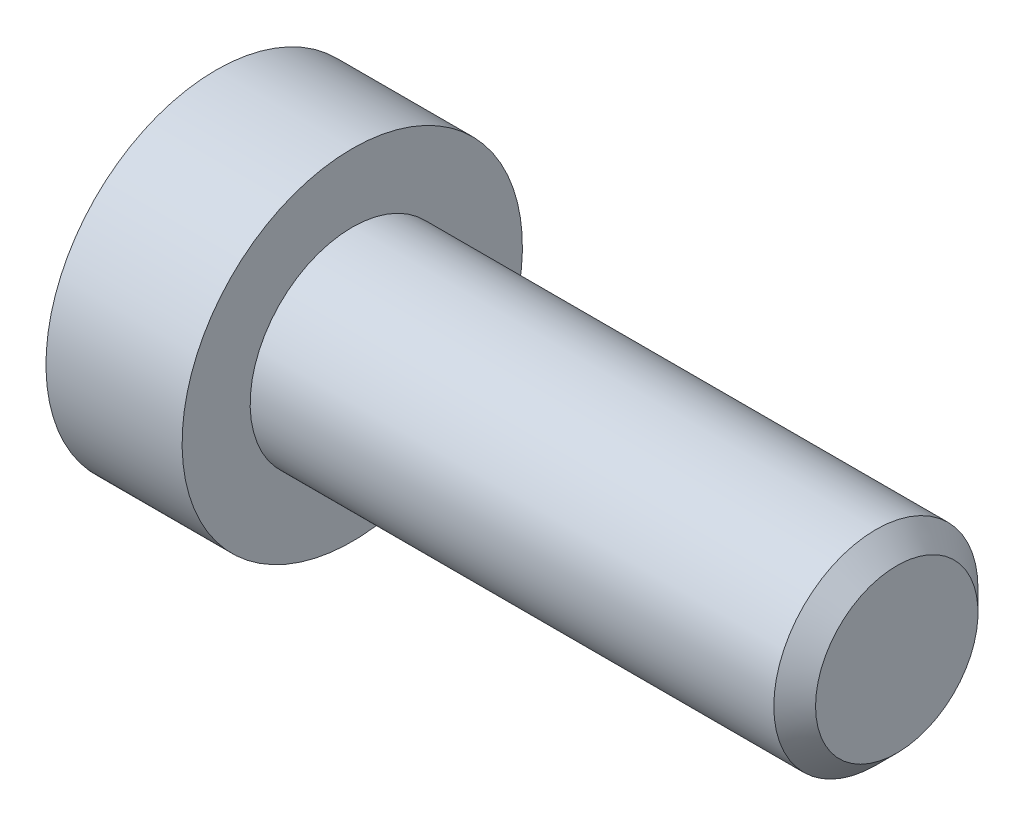
ISO-10303-21;
HEADER;
FILE_DESCRIPTION(('STEP AP214'),'2;1');
FILE_NAME('part.step','',(''),(''),'','','');
FILE_SCHEMA(('AUTOMOTIVE_DESIGN { 1 0 10303 214 1 1 1 1 }'));
ENDSEC;
DATA;
#1=APPLICATION_CONTEXT('core data for automotive mechanical design processes');
#2=APPLICATION_PROTOCOL_DEFINITION('international standard','automotive_design',2000,#1);
#3=PRODUCT_CONTEXT('',#1,'mechanical');
#4=PRODUCT('Part','Part','',(#3));
#5=PRODUCT_RELATED_PRODUCT_CATEGORY('part','',(#4));
#6=PRODUCT_DEFINITION_FORMATION('','',#4);
#7=PRODUCT_DEFINITION_CONTEXT('part definition',#1,'design');
#8=PRODUCT_DEFINITION('design','',#6,#7);
#9=PRODUCT_DEFINITION_SHAPE('','',#8);
#10=(LENGTH_UNIT() NAMED_UNIT(*) SI_UNIT(.MILLI.,.METRE.));
#11=(NAMED_UNIT(*) PLANE_ANGLE_UNIT() SI_UNIT($,.RADIAN.));
#12=(NAMED_UNIT(*) SI_UNIT($,.STERADIAN.) SOLID_ANGLE_UNIT());
#13=UNCERTAINTY_MEASURE_WITH_UNIT(LENGTH_MEASURE(1.E-05),#10,'distance_accuracy_value','');
#14=(GEOMETRIC_REPRESENTATION_CONTEXT(3) GLOBAL_UNCERTAINTY_ASSIGNED_CONTEXT((#13)) GLOBAL_UNIT_ASSIGNED_CONTEXT((#10,
#11,#12)) REPRESENTATION_CONTEXT('',''));
#15=CARTESIAN_POINT('',(0.,0.,0.));
#16=DIRECTION('',(0.,0.,1.));
#17=DIRECTION('',(1.,0.,0.));
#18=AXIS2_PLACEMENT_3D('',#15,#16,#17);
#19=CARTESIAN_POINT('',(0.999999999237389,0.,0.));
#20=DIRECTION('',(-1.,0.,0.));
#21=DIRECTION('',(0.,0.,1.));
#22=AXIS2_PLACEMENT_3D('',#19,#20,#21);
#23=CONICAL_SURFACE('',#22,1.49999999933925,1.04719754985988);
#24=CARTESIAN_POINT('',(1.86602540509284,-1.70530256582424E-10,0.));
#25=VERTEX_POINT('',#24);
#26=VERTEX_LOOP('',#25);
#27=FACE_BOUND('',#26,.T.);
#28=CARTESIAN_POINT('',(1.,0.,0.));
#29=DIRECTION('',(1.,0.,0.));
#30=DIRECTION('',(0.,1.,0.));
#31=AXIS2_PLACEMENT_3D('',#28,#29,#30);
#32=CIRCLE('',#31,1.5);
#33=CARTESIAN_POINT('',(1.,1.5,0.));
#34=VERTEX_POINT('',#33);
#35=EDGE_CURVE('E102',#34,#34,#32,.F.);
#36=ORIENTED_EDGE('',*,*,#35,.T.);
#37=EDGE_LOOP('',(#36));
#38=FACE_BOUND('',#37,.T.);
#39=ADVANCED_FACE('F15',(#27,#38),#23,.F.);
#40=CARTESIAN_POINT('',(0.150320631441119,0.,0.));
#41=DIRECTION('',(1.,0.,0.));
#42=DIRECTION('',(0.,1.,0.));
#43=AXIS2_PLACEMENT_3D('',#40,#41,#42);
#44=CYLINDRICAL_SURFACE('',#43,1.5);
#45=ORIENTED_EDGE('',*,*,#35,.F.);
#46=EDGE_LOOP('',(#45));
#47=FACE_BOUND('',#46,.T.);
#48=CARTESIAN_POINT('',(-0.699358736312661,0.,0.));
#49=DIRECTION('',(-1.,0.,0.));
#50=DIRECTION('',(0.,1.,0.));
#51=AXIS2_PLACEMENT_3D('',#48,#49,#50);
#52=CIRCLE('',#51,1.50000000047612);
#53=CARTESIAN_POINT('',(-0.699358736312661,1.50000000047612,0.));
#54=VERTEX_POINT('',#53);
#55=EDGE_CURVE('E83',#54,#54,#52,.T.);
#56=ORIENTED_EDGE('',*,*,#55,.T.);
#57=EDGE_LOOP('',(#56));
#58=FACE_BOUND('',#57,.T.);
#59=ADVANCED_FACE('F152',(#47,#58),#44,.F.);
#60=CARTESIAN_POINT('',(-1.50480384832008,0.,0.));
#61=DIRECTION('',(-1.,0.,0.));
#62=DIRECTION('',(0.,0.,1.));
#63=AXIS2_PLACEMENT_3D('',#60,#61,#62);
#64=CONICAL_SURFACE('',#63,2.89507185334514,1.04719755001073);
#65=ORIENTED_EDGE('',*,*,#55,.F.);
#66=EDGE_LOOP('',(#65));
#67=FACE_BOUND('',#66,.T.);
#68=CARTESIAN_POINT('',(-1.50000000090994,2.50000000020726,1.44337567271138));
#69=CARTESIAN_POINT('',(-1.46336943230046,2.50000000007444,1.31652043381892));
#70=CARTESIAN_POINT('',(-1.4300558472106,2.50000000001995,1.18857018231563));
#71=CARTESIAN_POINT('',(-1.37190798495513,2.49999999998001,0.930454306290177));
#72=CARTESIAN_POINT('',(-1.34709427605387,2.49999999999471,0.800284097041287));
#73=CARTESIAN_POINT('',(-1.30846994921723,2.50000000000517,0.541556812697644));
#74=CARTESIAN_POINT('',(-1.29440223500533,2.50000000000138,0.413039534960997));
#75=CARTESIAN_POINT('',(-1.27761146065546,2.49999999999863,0.155400578725887));
#76=CARTESIAN_POINT('',(-1.27487449296861,2.49999999999966,0.0262798360324409));
#77=CARTESIAN_POINT('',(-1.28058286324248,2.5000000000003,-0.214968419856101));
#78=CARTESIAN_POINT('',(-1.28762660709737,2.50000000000009,-0.327132134317981));
#79=CARTESIAN_POINT('',(-1.30994662654135,2.49999999999992,-0.550728853225329));
#80=CARTESIAN_POINT('',(-1.32523051914313,2.49999999999998,-0.662161084886667));
#81=CARTESIAN_POINT('',(-1.36343729244334,2.50000000000003,-0.886218434121961));
#82=CARTESIAN_POINT('',(-1.38652205359365,2.50000000000002,-0.998815208519759));
#83=CARTESIAN_POINT('',(-1.43891470197747,2.49999999999999,-1.22232986213441));
#84=CARTESIAN_POINT('',(-1.46821028692561,2.49999999999998,-1.33325060262345));
#85=CARTESIAN_POINT('',(-1.50000000104471,2.5,-1.44337567270819));
#86=B_SPLINE_CURVE_WITH_KNOTS('',3,(#68,#69,#70,#71,#72,#73,#74,#75,#76,#77,#78,#79,#80,#81,#82,
#83,#84,#85),.UNSPECIFIED.,.F.,.F.,(4,2,2,2,2,2,2,2,4),(0.,0.39627001456981,0.793492271541644,
1.18088450803327,1.56780111154381,1.9046347285053,2.2417802422547,2.58640202794493,
2.93034746654568),.UNSPECIFIED.);
#87=CARTESIAN_POINT('',(-1.5000000010352,2.4999999998706,1.44337567289935));
#88=VERTEX_POINT('',#87);
#89=CARTESIAN_POINT('',(-1.50000000107833,2.5,-1.44337567282465));
#90=VERTEX_POINT('',#89);
#91=EDGE_CURVE('E18',#88,#90,#86,.T.);
#92=ORIENTED_EDGE('',*,*,#91,.T.);
#93=CARTESIAN_POINT('',(-1.50000000090994,2.49999999987614,-1.4433756732849));
#94=CARTESIAN_POINT('',(-1.46336943230046,2.39014014032572,-1.5068032926161));
#95=CARTESIAN_POINT('',(-1.4300558472106,2.27933197207602,-1.57077841832056));
#96=CARTESIAN_POINT('',(-1.37190798495513,2.05579706629793,-1.69983635629869));
#97=CARTESIAN_POINT('',(-1.34709427605387,1.9430663582798,-1.76492146093587));
#98=CARTESIAN_POINT('',(-1.30846994921723,1.71900195739128,-1.89428510311675));
#99=CARTESIAN_POINT('',(-1.29440223500533,1.60770273004423,-1.95854374198179));
#100=CARTESIAN_POINT('',(-1.27761146065546,1.38458084893874,-2.08736322009696));
#101=CARTESIAN_POINT('',(-1.27487449296861,1.27275900561122,-2.15192359144458));
#102=CARTESIAN_POINT('',(-1.28058286324248,1.06383188739337,-2.27254771938941));
#103=CARTESIAN_POINT('',(-1.28762660709736,0.966695261286451,-2.32862957662016));
#104=CARTESIAN_POINT('',(-1.30994662654135,0.773054822509758,-2.44042793607369));
#105=CARTESIAN_POINT('',(-1.32523051914313,0.676551679090675,-2.49614405190441));
#106=CARTESIAN_POINT('',(-1.36343729244334,0.482512322748331,-2.6081727265221));
#107=CARTESIAN_POINT('',(-1.38652205359365,0.385000655735647,-2.66447111372099));
#108=CARTESIAN_POINT('',(-1.43891470197746,0.191431287587271,-2.77622844052829));
#109=CARTESIAN_POINT('',(-1.4682102869256,0.095371108517176,-2.8316888107728));
#110=CARTESIAN_POINT('',(-1.50000000104471,2.30253922132991E-10,-2.88675134581519));
#111=B_SPLINE_CURVE_WITH_KNOTS('',3,(#93,#94,#95,#96,#97,#98,#99,#100,#101,#102,#103,#104,#105,
#106,#107,#108,#109,#110),.UNSPECIFIED.,.F.,.F.,(4,2,2,2,2,2,2,2,4),(0.,0.39627001456981,
0.793492271541645,1.18088450803327,1.56780111154381,1.9046347285053,2.2417802422547,
2.58640202794493,2.93034746654569),.UNSPECIFIED.);
#112=CARTESIAN_POINT('',(-1.5000000010352,0.,-2.88675134579871));
#113=VERTEX_POINT('',#112);
#114=EDGE_CURVE('E107',#90,#113,#111,.T.);
#115=ORIENTED_EDGE('',*,*,#114,.T.);
#116=CARTESIAN_POINT('',(-1.50000000090994,-3.31114456527844E-10,-2.88675134599628));
#117=CARTESIAN_POINT('',(-1.46336943230046,-0.109859859748714,-2.82332372643503));
#118=CARTESIAN_POINT('',(-1.4300558472106,-0.220668027943928,-2.75934860063619));
#119=CARTESIAN_POINT('',(-1.37190798495513,-0.444202933682073,-2.63029066258887));
#120=CARTESIAN_POINT('',(-1.34709427605387,-0.5569336417149,-2.56520555797716));
#121=CARTESIAN_POINT('',(-1.30846994921723,-0.780998042613884,-2.43584191581439));
#122=CARTESIAN_POINT('',(-1.29440223500533,-0.892297269957147,-2.37158327694279));
#123=CARTESIAN_POINT('',(-1.27761146065546,-1.11541915105988,-2.24276379882285));
#124=CARTESIAN_POINT('',(-1.27487449296861,-1.22724099438844,-2.17820342747702));
#125=CARTESIAN_POINT('',(-1.28058286324248,-1.43616811260693,-2.05757929953331));
#126=CARTESIAN_POINT('',(-1.28762660709736,-1.53330473871363,-2.00149744230218));
#127=CARTESIAN_POINT('',(-1.30994662654135,-1.72694517749016,-1.88969908284837));
#128=CARTESIAN_POINT('',(-1.32523051914313,-1.8234483209093,-1.83398296701775));
#129=CARTESIAN_POINT('',(-1.36343729244334,-2.01748767725169,-1.72195429240014));
#130=CARTESIAN_POINT('',(-1.38652205359365,-2.11499934426437,-1.66565590520123));
#131=CARTESIAN_POINT('',(-1.43891470197746,-2.30856871241272,-1.55389857839388));
#132=CARTESIAN_POINT('',(-1.4682102869256,-2.4046288914828,-1.49843820814935));
#133=CARTESIAN_POINT('',(-1.50000000104471,-2.49999999976975,-1.443375673107));
#134=B_SPLINE_CURVE_WITH_KNOTS('',3,(#116,#117,#118,#119,#120,#121,#122,#123,#124,#125,#126,
#127,#128,#129,#130,#131,#132,#133),.UNSPECIFIED.,.F.,.F.,(4,2,2,2,2,2,2,2,4),(0.,
0.396270014569809,0.793492271541644,1.18088450803327,1.56780111154381,1.9046347285053,
2.2417802422547,2.58640202794493,2.93034746654569),.UNSPECIFIED.);
#135=CARTESIAN_POINT('',(-1.5000000010352,-2.4999999998706,-1.44337567289936));
#136=VERTEX_POINT('',#135);
#137=EDGE_CURVE('E141',#113,#136,#134,.T.);
#138=ORIENTED_EDGE('',*,*,#137,.T.);
#139=CARTESIAN_POINT('',(-1.50000000090994,-2.50000000020726,-1.44337567271139));
#140=CARTESIAN_POINT('',(-1.46336943230046,-2.50000000007444,-1.31652043381893));
#141=CARTESIAN_POINT('',(-1.4300558472106,-2.50000000001995,-1.18857018231564));
#142=CARTESIAN_POINT('',(-1.37190798495513,-2.49999999998,-0.930454306290184));
#143=CARTESIAN_POINT('',(-1.34709427605387,-2.49999999999471,-0.800284097041294));
#144=CARTESIAN_POINT('',(-1.30846994921723,-2.50000000000516,-0.541556812697651));
#145=CARTESIAN_POINT('',(-1.29440223500533,-2.50000000000138,-0.413039534961004));
#146=CARTESIAN_POINT('',(-1.27761146065546,-2.49999999999863,-0.155400578725895));
#147=CARTESIAN_POINT('',(-1.27487449296861,-2.49999999999966,-0.0262798360324483));
#148=CARTESIAN_POINT('',(-1.28058286324248,-2.5000000000003,0.214968419856093));
#149=CARTESIAN_POINT('',(-1.28762660709736,-2.50000000000008,0.327132134317974));
#150=CARTESIAN_POINT('',(-1.30994662654135,-2.49999999999992,0.550728853225323));
#151=CARTESIAN_POINT('',(-1.32523051914313,-2.49999999999998,0.662161084886662));
#152=CARTESIAN_POINT('',(-1.36343729244334,-2.50000000000002,0.886218434121957));
#153=CARTESIAN_POINT('',(-1.38652205359365,-2.50000000000001,0.998815208519755));
#154=CARTESIAN_POINT('',(-1.43891470197746,-2.49999999999999,1.2223298621344));
#155=CARTESIAN_POINT('',(-1.4682102869256,-2.49999999999998,1.33325060262344));
#156=CARTESIAN_POINT('',(-1.50000000104471,-2.5,1.44337567270819));
#157=B_SPLINE_CURVE_WITH_KNOTS('',3,(#139,#140,#141,#142,#143,#144,#145,#146,#147,#148,#149,
#150,#151,#152,#153,#154,#155,#156),.UNSPECIFIED.,.F.,.F.,(4,2,2,2,2,2,2,2,4),(0.,
0.396270014569809,0.793492271541644,1.18088450803327,1.56780111154381,1.9046347285053,
2.2417802422547,2.58640202794493,2.93034746654569),.UNSPECIFIED.);
#158=CARTESIAN_POINT('',(-1.5000000010352,-2.4999999998706,1.44337567289936));
#159=VERTEX_POINT('',#158);
#160=EDGE_CURVE('E165',#136,#159,#157,.T.);
#161=ORIENTED_EDGE('',*,*,#160,.T.);
#162=CARTESIAN_POINT('',(-1.50000000090994,-2.49999999987614,1.44337567328489));
#163=CARTESIAN_POINT('',(-1.46336943230046,-2.39014014032572,1.5068032926161));
#164=CARTESIAN_POINT('',(-1.4300558472106,-2.27933197207602,1.57077841832055));
#165=CARTESIAN_POINT('',(-1.37190798495513,-2.05579706629793,1.69983635629869));
#166=CARTESIAN_POINT('',(-1.34709427605387,-1.9430663582798,1.76492146093586));
#167=CARTESIAN_POINT('',(-1.30846994921723,-1.71900195739128,1.89428510311674));
#168=CARTESIAN_POINT('',(-1.29440223500533,-1.60770273004423,1.95854374198179));
#169=CARTESIAN_POINT('',(-1.27761146065546,-1.38458084893874,2.08736322009696));
#170=CARTESIAN_POINT('',(-1.27487449296861,-1.27275900561122,2.15192359144457));
#171=CARTESIAN_POINT('',(-1.28058286324248,-1.06383188739337,2.2725477193894));
#172=CARTESIAN_POINT('',(-1.28762660709736,-0.966695261286452,2.32862957662015));
#173=CARTESIAN_POINT('',(-1.30994662654135,-0.773054822509759,2.44042793607369));
#174=CARTESIAN_POINT('',(-1.32523051914313,-0.676551679090675,2.49614405190441));
#175=CARTESIAN_POINT('',(-1.36343729244334,-0.482512322748331,2.6081727265221));
#176=CARTESIAN_POINT('',(-1.38652205359365,-0.385000655735646,2.66447111372098));
#177=CARTESIAN_POINT('',(-1.43891470197746,-0.19143128758727,2.77622844052829));
#178=CARTESIAN_POINT('',(-1.4682102869256,-0.0953711085171749,2.8316888107728));
#179=CARTESIAN_POINT('',(-1.50000000104471,-2.30252668835411E-10,2.88675134581519));
#180=B_SPLINE_CURVE_WITH_KNOTS('',3,(#162,#163,#164,#165,#166,#167,#168,#169,#170,#171,#172,
#173,#174,#175,#176,#177,#178,#179),.UNSPECIFIED.,.F.,.F.,(4,2,2,2,2,2,2,2,4),(0.,
0.396270014569809,0.793492271541644,1.18088450803327,1.56780111154381,1.9046347285053,
2.2417802422547,2.58640202794493,2.93034746654569),.UNSPECIFIED.);
#181=CARTESIAN_POINT('',(-1.5000000010352,0.,2.88675134579871));
#182=VERTEX_POINT('',#181);
#183=EDGE_CURVE('E88',#159,#182,#180,.T.);
#184=ORIENTED_EDGE('',*,*,#183,.T.);
#185=CARTESIAN_POINT('',(-1.50000000090994,3.31115352756992E-10,2.88675134599628));
#186=CARTESIAN_POINT('',(-1.46336943230046,0.109859859748716,2.82332372643503));
#187=CARTESIAN_POINT('',(-1.4300558472106,0.220668027943929,2.75934860063619));
#188=CARTESIAN_POINT('',(-1.37190798495513,0.444202933682074,2.63029066258887));
#189=CARTESIAN_POINT('',(-1.34709427605387,0.556933641714901,2.56520555797716));
#190=CARTESIAN_POINT('',(-1.30846994921723,0.780998042613885,2.43584191581439));
#191=CARTESIAN_POINT('',(-1.29440223500533,0.892297269957148,2.37158327694279));
#192=CARTESIAN_POINT('',(-1.27761146065546,1.11541915105988,2.24276379882285));
#193=CARTESIAN_POINT('',(-1.27487449296861,1.22724099438844,2.17820342747702));
#194=CARTESIAN_POINT('',(-1.28058286324248,1.43616811260693,2.05757929953331));
#195=CARTESIAN_POINT('',(-1.28762660709736,1.53330473871363,2.00149744230218));
#196=CARTESIAN_POINT('',(-1.30994662654135,1.72694517749016,1.88969908284836));
#197=CARTESIAN_POINT('',(-1.32523051914313,1.8234483209093,1.83398296701774));
#198=CARTESIAN_POINT('',(-1.36343729244334,2.01748767725169,1.72195429240013));
#199=CARTESIAN_POINT('',(-1.38652205359365,2.11499934426437,1.66565590520122));
#200=CARTESIAN_POINT('',(-1.43891470197746,2.30856871241272,1.55389857839388));
#201=CARTESIAN_POINT('',(-1.4682102869256,2.40462889148281,1.49843820814935));
#202=CARTESIAN_POINT('',(-1.50000000104471,2.49999999976975,1.44337567310699));
#203=B_SPLINE_CURVE_WITH_KNOTS('',3,(#185,#186,#187,#188,#189,#190,#191,#192,#193,#194,#195,
#196,#197,#198,#199,#200,#201,#202),.UNSPECIFIED.,.F.,.F.,(4,2,2,2,2,2,2,2,4),(0.,
0.39627001456981,0.793492271541644,1.18088450803327,1.56780111154381,1.9046347285053,
2.2417802422547,2.58640202794494,2.9303474665457),.UNSPECIFIED.);
#204=EDGE_CURVE('E85',#182,#88,#203,.T.);
#205=ORIENTED_EDGE('',*,*,#204,.T.);
#206=EDGE_LOOP('',(#92,#115,#138,#161,#184,#205));
#207=FACE_BOUND('',#206,.T.);
#208=ADVANCED_FACE('F86',(#67,#207),#64,.F.);
#209=CARTESIAN_POINT('',(-3.99999999999999,2.5,1.44337567297406));
#210=DIRECTION('',(0.,1.,0.));
#211=DIRECTION('',(0.,0.,1.));
#212=AXIS2_PLACEMENT_3D('',#209,#210,#211);
#213=PLANE('',#212);
#214=DIRECTION('',(1.,0.,0.));
#215=VECTOR('',#214,1.);
#216=CARTESIAN_POINT('',(-3.99999999999999,2.5,1.44337567297406));
#217=LINE('',#216,#215);
#218=CARTESIAN_POINT('',(-3.99999999999999,2.5,1.44337567297406));
#219=VERTEX_POINT('',#218);
#220=EDGE_CURVE('E76',#88,#219,#217,.F.);
#221=ORIENTED_EDGE('',*,*,#220,.T.);
#222=DIRECTION('',(0.,0.,1.));
#223=VECTOR('',#222,1.);
#224=CARTESIAN_POINT('',(-3.99999999999999,2.5,0.));
#225=LINE('',#224,#223);
#226=CARTESIAN_POINT('',(-3.99999999999999,2.5,-1.44337567297407));
#227=VERTEX_POINT('',#226);
#228=EDGE_CURVE('E105',#227,#219,#225,.T.);
#229=ORIENTED_EDGE('',*,*,#228,.F.);
#230=DIRECTION('',(1.,0.,0.));
#231=VECTOR('',#230,1.);
#232=CARTESIAN_POINT('',(-3.99999999999999,2.5,-1.44337567297407));
#233=LINE('',#232,#231);
#234=EDGE_CURVE('E79',#227,#90,#233,.T.);
#235=ORIENTED_EDGE('',*,*,#234,.T.);
#236=ORIENTED_EDGE('',*,*,#91,.F.);
#237=EDGE_LOOP('',(#221,#229,#235,#236));
#238=FACE_BOUND('',#237,.T.);
#239=ADVANCED_FACE('F73',(#238),#213,.F.);
#240=CARTESIAN_POINT('',(-3.99999999999999,0.,2.88675134594813));
#241=DIRECTION('',(0.,0.500000000000001,0.866025403784438));
#242=DIRECTION('',(0.,-0.866025403784438,0.500000000000001));
#243=AXIS2_PLACEMENT_3D('',#240,#241,#242);
#244=PLANE('',#243);
#245=DIRECTION('',(1.,0.,0.));
#246=VECTOR('',#245,1.);
#247=CARTESIAN_POINT('',(-3.99999999999999,0.,2.88675134594813));
#248=LINE('',#247,#246);
#249=CARTESIAN_POINT('',(-3.99999999999999,0.,2.88675134594813));
#250=VERTEX_POINT('',#249);
#251=EDGE_CURVE('E91',#182,#250,#248,.F.);
#252=ORIENTED_EDGE('',*,*,#251,.T.);
#253=DIRECTION('',(0.,-0.866025403784438,0.500000000000001));
#254=VECTOR('',#253,1.);
#255=CARTESIAN_POINT('',(-3.99999999999999,2.5,1.44337567297406));
#256=LINE('',#255,#254);
#257=EDGE_CURVE('E94',#219,#250,#256,.T.);
#258=ORIENTED_EDGE('',*,*,#257,.F.);
#259=ORIENTED_EDGE('',*,*,#220,.F.);
#260=ORIENTED_EDGE('',*,*,#204,.F.);
#261=EDGE_LOOP('',(#252,#258,#259,#260));
#262=FACE_BOUND('',#261,.T.);
#263=ADVANCED_FACE('F92',(#262),#244,.F.);
#264=CARTESIAN_POINT('',(-3.99999999999999,-2.5,1.44337567297406));
#265=DIRECTION('',(0.,-0.5,0.866025403784439));
#266=DIRECTION('',(0.,-0.866025403784439,-0.5));
#267=AXIS2_PLACEMENT_3D('',#264,#265,#266);
#268=PLANE('',#267);
#269=DIRECTION('',(1.,0.,0.));
#270=VECTOR('',#269,1.);
#271=CARTESIAN_POINT('',(-3.99999999999999,-2.5,1.44337567297406));
#272=LINE('',#271,#270);
#273=CARTESIAN_POINT('',(-3.99999999999999,-2.5,1.44337567297407));
#274=VERTEX_POINT('',#273);
#275=EDGE_CURVE('E174',#159,#274,#272,.F.);
#276=ORIENTED_EDGE('',*,*,#275,.T.);
#277=DIRECTION('',(0.,-0.866025403784439,-0.5));
#278=VECTOR('',#277,1.);
#279=CARTESIAN_POINT('',(-3.99999999999999,0.,2.88675134594813));
#280=LINE('',#279,#278);
#281=EDGE_CURVE('E118',#250,#274,#280,.T.);
#282=ORIENTED_EDGE('',*,*,#281,.F.);
#283=ORIENTED_EDGE('',*,*,#251,.F.);
#284=ORIENTED_EDGE('',*,*,#183,.F.);
#285=EDGE_LOOP('',(#276,#282,#283,#284));
#286=FACE_BOUND('',#285,.T.);
#287=ADVANCED_FACE('F175',(#286),#268,.F.);
#288=CARTESIAN_POINT('',(-3.99999999999999,-2.5,-1.44337567297406));
#289=DIRECTION('',(0.,-1.,0.));
#290=DIRECTION('',(0.,0.,-1.));
#291=AXIS2_PLACEMENT_3D('',#288,#289,#290);
#292=PLANE('',#291);
#293=DIRECTION('',(1.,0.,0.));
#294=VECTOR('',#293,1.);
#295=CARTESIAN_POINT('',(-3.99999999999999,-2.5,-1.44337567297406));
#296=LINE('',#295,#294);
#297=CARTESIAN_POINT('',(-3.99999999999999,-2.5,-1.44337567297406));
#298=VERTEX_POINT('',#297);
#299=EDGE_CURVE('E226',#136,#298,#296,.F.);
#300=ORIENTED_EDGE('',*,*,#299,.T.);
#301=DIRECTION('',(0.,0.,1.));
#302=VECTOR('',#301,1.);
#303=CARTESIAN_POINT('',(-3.99999999999999,-2.5,0.));
#304=LINE('',#303,#302);
#305=EDGE_CURVE('E115',#274,#298,#304,.F.);
#306=ORIENTED_EDGE('',*,*,#305,.F.);
#307=ORIENTED_EDGE('',*,*,#275,.F.);
#308=ORIENTED_EDGE('',*,*,#160,.F.);
#309=EDGE_LOOP('',(#300,#306,#307,#308));
#310=FACE_BOUND('',#309,.T.);
#311=ADVANCED_FACE('F178',(#310),#292,.F.);
#312=CARTESIAN_POINT('',(-3.99999999999999,0.,-2.88675134594813));
#313=DIRECTION('',(0.,-0.5,-0.866025403784439));
#314=DIRECTION('',(0.,0.866025403784439,-0.5));
#315=AXIS2_PLACEMENT_3D('',#312,#313,#314);
#316=PLANE('',#315);
#317=DIRECTION('',(1.,0.,0.));
#318=VECTOR('',#317,1.);
#319=CARTESIAN_POINT('',(-3.99999999999999,0.,-2.88675134594813));
#320=LINE('',#319,#318);
#321=CARTESIAN_POINT('',(-3.99999999999999,0.,-2.88675134594813));
#322=VERTEX_POINT('',#321);
#323=EDGE_CURVE('E38',#113,#322,#320,.F.);
#324=ORIENTED_EDGE('',*,*,#323,.T.);
#325=DIRECTION('',(0.,0.866025403784439,-0.5));
#326=VECTOR('',#325,1.);
#327=CARTESIAN_POINT('',(-3.99999999999999,-2.5,-1.44337567297406));
#328=LINE('',#327,#326);
#329=EDGE_CURVE('E112',#298,#322,#328,.T.);
#330=ORIENTED_EDGE('',*,*,#329,.F.);
#331=ORIENTED_EDGE('',*,*,#299,.F.);
#332=ORIENTED_EDGE('',*,*,#137,.F.);
#333=EDGE_LOOP('',(#324,#330,#331,#332));
#334=FACE_BOUND('',#333,.T.);
#335=ADVANCED_FACE('F217',(#334),#316,.F.);
#336=CARTESIAN_POINT('',(-3.99999999999999,2.5,-1.44337567297407));
#337=DIRECTION('',(0.,0.5,-0.866025403784439));
#338=DIRECTION('',(0.,0.866025403784439,0.5));
#339=AXIS2_PLACEMENT_3D('',#336,#337,#338);
#340=PLANE('',#339);
#341=ORIENTED_EDGE('',*,*,#234,.F.);
#342=DIRECTION('',(0.,0.866025403784439,0.5));
#343=VECTOR('',#342,1.);
#344=CARTESIAN_POINT('',(-3.99999999999999,0.,-2.88675134594813));
#345=LINE('',#344,#343);
#346=EDGE_CURVE('E108',#322,#227,#345,.T.);
#347=ORIENTED_EDGE('',*,*,#346,.F.);
#348=ORIENTED_EDGE('',*,*,#323,.F.);
#349=ORIENTED_EDGE('',*,*,#114,.F.);
#350=EDGE_LOOP('',(#341,#347,#348,#349));
#351=FACE_BOUND('',#350,.T.);
#352=ADVANCED_FACE('F147',(#351),#340,.F.);
#353=CARTESIAN_POINT('',(-3.99999999999999,3.94337567297406,0.));
#354=DIRECTION('',(-1.,0.,0.));
#355=DIRECTION('',(0.,0.,1.));
#356=AXIS2_PLACEMENT_3D('',#353,#354,#355);
#357=PLANE('',#356);
#358=ORIENTED_EDGE('',*,*,#329,.T.);
#359=ORIENTED_EDGE('',*,*,#346,.T.);
#360=ORIENTED_EDGE('',*,*,#228,.T.);
#361=ORIENTED_EDGE('',*,*,#257,.T.);
#362=ORIENTED_EDGE('',*,*,#281,.T.);
#363=ORIENTED_EDGE('',*,*,#305,.T.);
#364=EDGE_LOOP('',(#358,#359,#360,#361,#362,#363));
#365=FACE_BOUND('',#364,.T.);
#366=CARTESIAN_POINT('',(-3.99999999999999,0.,0.));
#367=DIRECTION('',(1.,0.,0.));
#368=DIRECTION('',(0.,1.,0.));
#369=AXIS2_PLACEMENT_3D('',#366,#367,#368);
#370=CIRCLE('',#369,5.);
#371=CARTESIAN_POINT('',(-3.99999999999999,5.,0.));
#372=VERTEX_POINT('',#371);
#373=EDGE_CURVE('E111',#372,#372,#370,.T.);
#374=ORIENTED_EDGE('',*,*,#373,.F.);
#375=EDGE_LOOP('',(#374));
#376=FACE_BOUND('',#375,.T.);
#377=ADVANCED_FACE('F210',(#365,#376),#357,.T.);
#378=CARTESIAN_POINT('',(-2.,0.,0.));
#379=DIRECTION('',(1.,0.,0.));
#380=DIRECTION('',(0.,1.,0.));
#381=AXIS2_PLACEMENT_3D('',#378,#379,#380);
#382=CYLINDRICAL_SURFACE('',#381,5.);
#383=ORIENTED_EDGE('',*,*,#373,.T.);
#384=EDGE_LOOP('',(#383));
#385=FACE_BOUND('',#384,.T.);
#386=CARTESIAN_POINT('',(0.,0.,0.));
#387=DIRECTION('',(1.,0.,0.));
#388=DIRECTION('',(0.,1.,0.));
#389=AXIS2_PLACEMENT_3D('',#386,#387,#388);
#390=CIRCLE('',#389,5.);
#391=CARTESIAN_POINT('',(0.,5.,0.));
#392=VERTEX_POINT('',#391);
#393=EDGE_CURVE('E131',#392,#392,#390,.T.);
#394=ORIENTED_EDGE('',*,*,#393,.F.);
#395=EDGE_LOOP('',(#394));
#396=FACE_BOUND('',#395,.T.);
#397=ADVANCED_FACE('F207',(#385,#396),#382,.T.);
#398=CARTESIAN_POINT('',(16.,1.5,0.));
#399=DIRECTION('',(1.,0.,0.));
#400=DIRECTION('',(0.,0.,-1.));
#401=AXIS2_PLACEMENT_3D('',#398,#399,#400);
#402=PLANE('',#401);
#403=CARTESIAN_POINT('',(16.0000000002469,0.,0.));
#404=DIRECTION('',(-1.,0.,0.));
#405=DIRECTION('',(0.,0.,1.));
#406=AXIS2_PLACEMENT_3D('',#403,#404,#405);
#407=CIRCLE('',#406,2.38655000026711);
#408=CARTESIAN_POINT('',(16.0000000002469,0.,2.38655000026711));
#409=VERTEX_POINT('',#408);
#410=EDGE_CURVE('E128',#409,#409,#407,.T.);
#411=ORIENTED_EDGE('',*,*,#410,.F.);
#412=EDGE_LOOP('',(#411));
#413=FACE_BOUND('',#412,.T.);
#414=ADVANCED_FACE('F203',(#413),#402,.T.);
#415=CARTESIAN_POINT('',(0.,4.,0.));
#416=DIRECTION('',(1.,0.,0.));
#417=DIRECTION('',(0.,0.,-1.));
#418=AXIS2_PLACEMENT_3D('',#415,#416,#417);
#419=PLANE('',#418);
#420=CARTESIAN_POINT('',(0.,0.,0.));
#421=DIRECTION('',(1.,0.,0.));
#422=DIRECTION('',(0.,1.,0.));
#423=AXIS2_PLACEMENT_3D('',#420,#421,#422);
#424=CIRCLE('',#423,3.);
#425=CARTESIAN_POINT('',(0.,3.,0.));
#426=VERTEX_POINT('',#425);
#427=EDGE_CURVE('E29',#426,#426,#424,.T.);
#428=ORIENTED_EDGE('',*,*,#427,.F.);
#429=EDGE_LOOP('',(#428));
#430=FACE_BOUND('',#429,.T.);
#431=ORIENTED_EDGE('',*,*,#393,.T.);
#432=EDGE_LOOP('',(#431));
#433=FACE_BOUND('',#432,.T.);
#434=ADVANCED_FACE('F196',(#430,#433),#419,.T.);
#435=CARTESIAN_POINT('',(15.3865499996755,0.,0.));
#436=DIRECTION('',(-1.,0.,0.));
#437=DIRECTION('',(0.,0.,1.));
#438=AXIS2_PLACEMENT_3D('',#435,#436,#437);
#439=CONICAL_SURFACE('',#438,2.99999999975853,0.785398162517161);
#440=ORIENTED_EDGE('',*,*,#410,.T.);
#441=EDGE_LOOP('',(#440));
#442=FACE_BOUND('',#441,.T.);
#443=CARTESIAN_POINT('',(15.38655,0.,0.));
#444=DIRECTION('',(1.,0.,0.));
#445=DIRECTION('',(0.,1.,0.));
#446=AXIS2_PLACEMENT_3D('',#443,#444,#445);
#447=CIRCLE('',#446,3.);
#448=CARTESIAN_POINT('',(15.38655,3.,0.));
#449=VERTEX_POINT('',#448);
#450=EDGE_CURVE('E9',#449,#449,#447,.F.);
#451=ORIENTED_EDGE('',*,*,#450,.F.);
#452=EDGE_LOOP('',(#451));
#453=FACE_BOUND('',#452,.T.);
#454=ADVANCED_FACE('F189',(#442,#453),#439,.T.);
#455=CARTESIAN_POINT('',(8.00000000000001,0.,0.));
#456=DIRECTION('',(1.,0.,0.));
#457=DIRECTION('',(0.,1.,0.));
#458=AXIS2_PLACEMENT_3D('',#455,#456,#457);
#459=CYLINDRICAL_SURFACE('',#458,3.);
#460=ORIENTED_EDGE('',*,*,#450,.T.);
#461=EDGE_LOOP('',(#460));
#462=FACE_BOUND('',#461,.T.);
#463=ORIENTED_EDGE('',*,*,#427,.T.);
#464=EDGE_LOOP('',(#463));
#465=FACE_BOUND('',#464,.T.);
#466=ADVANCED_FACE('F187',(#462,#465),#459,.T.);
#467=CLOSED_SHELL('',(#39,#59,#208,#239,#263,#287,#311,#335,#352,#377,#397,#414,#434,#454,#466));
#468=MANIFOLD_SOLID_BREP('B1',#467);
#469=ADVANCED_BREP_SHAPE_REPRESENTATION('',(#18,#468),#14);
#470=SHAPE_DEFINITION_REPRESENTATION(#9,#469);
ENDSEC;
END-ISO-10303-21;
